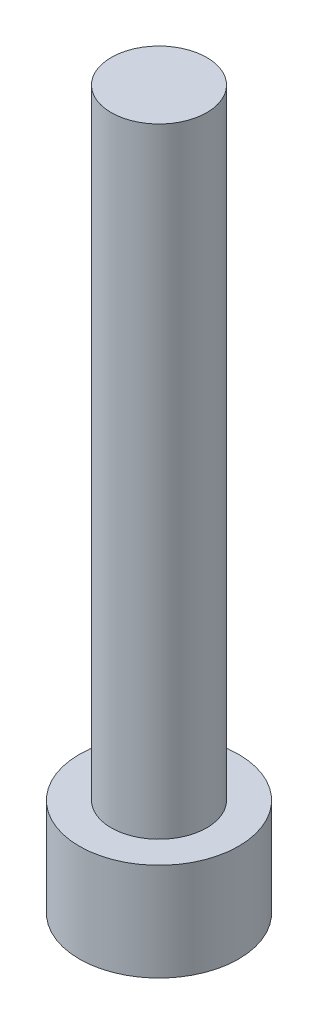
ISO-10303-21;
HEADER;
FILE_DESCRIPTION(('STEP AP214'),'2;1');
FILE_NAME('part.step','',(''),(''),'','','');
FILE_SCHEMA(('AUTOMOTIVE_DESIGN { 1 0 10303 214 1 1 1 1 }'));
ENDSEC;
DATA;
#1=APPLICATION_CONTEXT('core data for automotive mechanical design processes');
#2=APPLICATION_PROTOCOL_DEFINITION('international standard','automotive_design',2000,#1);
#3=PRODUCT_CONTEXT('',#1,'mechanical');
#4=PRODUCT('Part','Part','',(#3));
#5=PRODUCT_RELATED_PRODUCT_CATEGORY('part','',(#4));
#6=PRODUCT_DEFINITION_FORMATION('','',#4);
#7=PRODUCT_DEFINITION_CONTEXT('part definition',#1,'design');
#8=PRODUCT_DEFINITION('design','',#6,#7);
#9=PRODUCT_DEFINITION_SHAPE('','',#8);
#10=(LENGTH_UNIT() NAMED_UNIT(*) SI_UNIT(.MILLI.,.METRE.));
#11=(NAMED_UNIT(*) PLANE_ANGLE_UNIT() SI_UNIT($,.RADIAN.));
#12=(NAMED_UNIT(*) SI_UNIT($,.STERADIAN.) SOLID_ANGLE_UNIT());
#13=UNCERTAINTY_MEASURE_WITH_UNIT(LENGTH_MEASURE(1.E-05),#10,'distance_accuracy_value','');
#14=(GEOMETRIC_REPRESENTATION_CONTEXT(3) GLOBAL_UNCERTAINTY_ASSIGNED_CONTEXT((#13)) GLOBAL_UNIT_ASSIGNED_CONTEXT((#10,
#11,#12)) REPRESENTATION_CONTEXT('',''));
#15=CARTESIAN_POINT('',(0.,0.,0.));
#16=DIRECTION('',(0.,0.,1.));
#17=DIRECTION('',(1.,0.,0.));
#18=AXIS2_PLACEMENT_3D('',#15,#16,#17);
#19=CARTESIAN_POINT('',(0.,3.5052,0.));
#20=DIRECTION('',(0.,1.,0.));
#21=DIRECTION('',(0.,0.,1.));
#22=AXIS2_PLACEMENT_3D('',#19,#20,#21);
#23=PLANE('',#22);
#24=CARTESIAN_POINT('',(0.,3.5052,0.));
#25=DIRECTION('',(0.,1.,0.));
#26=DIRECTION('',(0.,0.,1.));
#27=AXIS2_PLACEMENT_3D('',#24,#25,#26);
#28=CIRCLE('',#27,2.8575);
#29=CARTESIAN_POINT('',(0.,3.5052,2.8575));
#30=VERTEX_POINT('',#29);
#31=EDGE_CURVE('E11',#30,#30,#28,.T.);
#32=ORIENTED_EDGE('',*,*,#31,.T.);
#33=EDGE_LOOP('',(#32));
#34=FACE_BOUND('',#33,.T.);
#35=CARTESIAN_POINT('',(0.,3.5052,0.));
#36=DIRECTION('',(0.,1.,0.));
#37=DIRECTION('',(0.,0.,1.));
#38=AXIS2_PLACEMENT_3D('',#35,#36,#37);
#39=CIRCLE('',#38,1.7145);
#40=CARTESIAN_POINT('',(0.,3.5052,1.7145));
#41=VERTEX_POINT('',#40);
#42=EDGE_CURVE('E152',#41,#41,#39,.T.);
#43=ORIENTED_EDGE('',*,*,#42,.F.);
#44=EDGE_LOOP('',(#43));
#45=FACE_BOUND('',#44,.T.);
#46=ADVANCED_FACE('F33',(#34,#45),#23,.T.);
#47=CARTESIAN_POINT('',(0.,3.5052,0.));
#48=DIRECTION('',(0.,-1.,0.));
#49=DIRECTION('',(0.,0.,-1.));
#50=AXIS2_PLACEMENT_3D('',#47,#48,#49);
#51=CYLINDRICAL_SURFACE('',#50,2.8575);
#52=ORIENTED_EDGE('',*,*,#31,.F.);
#53=EDGE_LOOP('',(#52));
#54=FACE_BOUND('',#53,.T.);
#55=CARTESIAN_POINT('',(0.,0.,0.));
#56=DIRECTION('',(0.,1.,0.));
#57=DIRECTION('',(0.,0.,1.));
#58=AXIS2_PLACEMENT_3D('',#55,#56,#57);
#59=CIRCLE('',#58,2.8575);
#60=CARTESIAN_POINT('',(0.,0.,2.8575));
#61=VERTEX_POINT('',#60);
#62=EDGE_CURVE('E37',#61,#61,#59,.T.);
#63=ORIENTED_EDGE('',*,*,#62,.T.);
#64=EDGE_LOOP('',(#63));
#65=FACE_BOUND('',#64,.T.);
#66=ADVANCED_FACE('F35',(#54,#65),#51,.T.);
#67=CARTESIAN_POINT('',(0.,0.,0.));
#68=DIRECTION('',(0.,1.,0.));
#69=DIRECTION('',(0.,0.,1.));
#70=AXIS2_PLACEMENT_3D('',#67,#68,#69);
#71=PLANE('',#70);
#72=DIRECTION('',(-0.500000000000001,0.,0.866025403784438));
#73=VECTOR('',#72,1.);
#74=CARTESIAN_POINT('',(1.60395121659243,0.,0.));
#75=LINE('',#74,#73);
#76=CARTESIAN_POINT('',(1.60395121659243,0.,0.));
#77=VERTEX_POINT('',#76);
#78=CARTESIAN_POINT('',(0.801975608296214,0.,1.3890625));
#79=VERTEX_POINT('',#78);
#80=EDGE_CURVE('E122',#77,#79,#75,.T.);
#81=ORIENTED_EDGE('',*,*,#80,.F.);
#82=DIRECTION('',(0.5,0.,0.866025403784439));
#83=VECTOR('',#82,1.);
#84=CARTESIAN_POINT('',(0.801975608296215,0.,-1.3890625));
#85=LINE('',#84,#83);
#86=CARTESIAN_POINT('',(0.801975608296215,0.,-1.3890625));
#87=VERTEX_POINT('',#86);
#88=EDGE_CURVE('E48',#87,#77,#85,.T.);
#89=ORIENTED_EDGE('',*,*,#88,.F.);
#90=DIRECTION('',(1.,0.,0.));
#91=VECTOR('',#90,1.);
#92=CARTESIAN_POINT('',(-0.801975608296214,0.,-1.3890625));
#93=LINE('',#92,#91);
#94=CARTESIAN_POINT('',(-0.801975608296214,0.,-1.3890625));
#95=VERTEX_POINT('',#94);
#96=EDGE_CURVE('E132',#95,#87,#93,.T.);
#97=ORIENTED_EDGE('',*,*,#96,.F.);
#98=DIRECTION('',(0.5,0.,-0.866025403784438));
#99=VECTOR('',#98,1.);
#100=CARTESIAN_POINT('',(-1.60395121659243,0.,0.));
#101=LINE('',#100,#99);
#102=CARTESIAN_POINT('',(-1.60395121659243,0.,0.));
#103=VERTEX_POINT('',#102);
#104=EDGE_CURVE('E130',#103,#95,#101,.T.);
#105=ORIENTED_EDGE('',*,*,#104,.F.);
#106=DIRECTION('',(-0.5,0.,-0.866025403784439));
#107=VECTOR('',#106,1.);
#108=CARTESIAN_POINT('',(-0.801975608296214,0.,1.3890625));
#109=LINE('',#108,#107);
#110=CARTESIAN_POINT('',(-0.801975608296214,0.,1.3890625));
#111=VERTEX_POINT('',#110);
#112=EDGE_CURVE('E96',#111,#103,#109,.T.);
#113=ORIENTED_EDGE('',*,*,#112,.F.);
#114=DIRECTION('',(-1.,0.,0.));
#115=VECTOR('',#114,1.);
#116=CARTESIAN_POINT('',(0.801975608296214,0.,1.3890625));
#117=LINE('',#116,#115);
#118=EDGE_CURVE('E126',#79,#111,#117,.T.);
#119=ORIENTED_EDGE('',*,*,#118,.F.);
#120=EDGE_LOOP('',(#81,#89,#97,#105,#113,#119));
#121=FACE_BOUND('',#120,.T.);
#122=ORIENTED_EDGE('',*,*,#62,.F.);
#123=EDGE_LOOP('',(#122));
#124=FACE_BOUND('',#123,.T.);
#125=ADVANCED_FACE('F145',(#121,#124),#71,.F.);
#126=CARTESIAN_POINT('',(0.801975608296215,1.9558,-1.3890625));
#127=DIRECTION('',(0.866025403784438,0.,-0.5));
#128=DIRECTION('',(-0.5,0.,-0.866025403784439));
#129=AXIS2_PLACEMENT_3D('',#126,#127,#128);
#130=PLANE('',#129);
#131=ORIENTED_EDGE('',*,*,#88,.T.);
#132=DIRECTION('',(0.,-1.,0.));
#133=VECTOR('',#132,1.);
#134=CARTESIAN_POINT('',(1.60395121659243,1.9558,0.));
#135=LINE('',#134,#133);
#136=CARTESIAN_POINT('',(1.60395121659243,1.9558,0.));
#137=VERTEX_POINT('',#136);
#138=EDGE_CURVE('E78',#137,#77,#135,.T.);
#139=ORIENTED_EDGE('',*,*,#138,.F.);
#140=DIRECTION('',(0.5,0.,0.866025403784439));
#141=VECTOR('',#140,1.);
#142=CARTESIAN_POINT('',(0.801975608296215,1.9558,-1.3890625));
#143=LINE('',#142,#141);
#144=CARTESIAN_POINT('',(0.801975608296215,1.9558,-1.3890625));
#145=VERTEX_POINT('',#144);
#146=EDGE_CURVE('E134',#145,#137,#143,.T.);
#147=ORIENTED_EDGE('',*,*,#146,.F.);
#148=DIRECTION('',(0.,-1.,0.));
#149=VECTOR('',#148,1.);
#150=CARTESIAN_POINT('',(0.801975608296215,1.9558,-1.3890625));
#151=LINE('',#150,#149);
#152=EDGE_CURVE('E56',#145,#87,#151,.T.);
#153=ORIENTED_EDGE('',*,*,#152,.T.);
#154=EDGE_LOOP('',(#131,#139,#147,#153));
#155=FACE_BOUND('',#154,.T.);
#156=ADVANCED_FACE('F174',(#155),#130,.F.);
#157=CARTESIAN_POINT('',(-0.801975608296214,1.9558,-1.3890625));
#158=DIRECTION('',(0.,0.,-1.));
#159=DIRECTION('',(-1.,0.,0.));
#160=AXIS2_PLACEMENT_3D('',#157,#158,#159);
#161=PLANE('',#160);
#162=ORIENTED_EDGE('',*,*,#96,.T.);
#163=ORIENTED_EDGE('',*,*,#152,.F.);
#164=DIRECTION('',(1.,0.,0.));
#165=VECTOR('',#164,1.);
#166=CARTESIAN_POINT('',(-0.801975608296214,1.9558,-1.3890625));
#167=LINE('',#166,#165);
#168=CARTESIAN_POINT('',(-0.801975608296214,1.9558,-1.3890625));
#169=VERTEX_POINT('',#168);
#170=EDGE_CURVE('E108',#169,#145,#167,.T.);
#171=ORIENTED_EDGE('',*,*,#170,.F.);
#172=DIRECTION('',(0.,-1.,0.));
#173=VECTOR('',#172,1.);
#174=CARTESIAN_POINT('',(-0.801975608296214,1.9558,-1.3890625));
#175=LINE('',#174,#173);
#176=EDGE_CURVE('E100',#169,#95,#175,.T.);
#177=ORIENTED_EDGE('',*,*,#176,.T.);
#178=EDGE_LOOP('',(#162,#163,#171,#177));
#179=FACE_BOUND('',#178,.T.);
#180=ADVANCED_FACE('F180',(#179),#161,.F.);
#181=CARTESIAN_POINT('',(-1.60395121659243,1.9558,0.));
#182=DIRECTION('',(-0.866025403784438,0.,-0.5));
#183=DIRECTION('',(-0.5,0.,0.866025403784439));
#184=AXIS2_PLACEMENT_3D('',#181,#182,#183);
#185=PLANE('',#184);
#186=ORIENTED_EDGE('',*,*,#104,.T.);
#187=ORIENTED_EDGE('',*,*,#176,.F.);
#188=DIRECTION('',(0.5,0.,-0.866025403784438));
#189=VECTOR('',#188,1.);
#190=CARTESIAN_POINT('',(-1.60395121659243,1.9558,0.));
#191=LINE('',#190,#189);
#192=CARTESIAN_POINT('',(-1.60395121659243,1.9558,0.));
#193=VERTEX_POINT('',#192);
#194=EDGE_CURVE('E104',#193,#169,#191,.T.);
#195=ORIENTED_EDGE('',*,*,#194,.F.);
#196=DIRECTION('',(0.,-1.,0.));
#197=VECTOR('',#196,1.);
#198=CARTESIAN_POINT('',(-1.60395121659243,1.9558,0.));
#199=LINE('',#198,#197);
#200=EDGE_CURVE('E89',#193,#103,#199,.T.);
#201=ORIENTED_EDGE('',*,*,#200,.T.);
#202=EDGE_LOOP('',(#186,#187,#195,#201));
#203=FACE_BOUND('',#202,.T.);
#204=ADVANCED_FACE('F105',(#203),#185,.F.);
#205=CARTESIAN_POINT('',(-0.801975608296214,1.9558,1.3890625));
#206=DIRECTION('',(-0.866025403784439,0.,0.5));
#207=DIRECTION('',(0.5,0.,0.866025403784439));
#208=AXIS2_PLACEMENT_3D('',#205,#206,#207);
#209=PLANE('',#208);
#210=ORIENTED_EDGE('',*,*,#112,.T.);
#211=ORIENTED_EDGE('',*,*,#200,.F.);
#212=DIRECTION('',(-0.5,0.,-0.866025403784439));
#213=VECTOR('',#212,1.);
#214=CARTESIAN_POINT('',(-0.801975608296214,1.9558,1.3890625));
#215=LINE('',#214,#213);
#216=CARTESIAN_POINT('',(-0.801975608296214,1.9558,1.3890625));
#217=VERTEX_POINT('',#216);
#218=EDGE_CURVE('E93',#217,#193,#215,.T.);
#219=ORIENTED_EDGE('',*,*,#218,.F.);
#220=DIRECTION('',(0.,-1.,0.));
#221=VECTOR('',#220,1.);
#222=CARTESIAN_POINT('',(-0.801975608296214,1.9558,1.3890625));
#223=LINE('',#222,#221);
#224=EDGE_CURVE('E101',#217,#111,#223,.T.);
#225=ORIENTED_EDGE('',*,*,#224,.T.);
#226=EDGE_LOOP('',(#210,#211,#219,#225));
#227=FACE_BOUND('',#226,.T.);
#228=ADVANCED_FACE('F91',(#227),#209,.F.);
#229=CARTESIAN_POINT('',(0.801975608296214,1.9558,1.3890625));
#230=DIRECTION('',(0.,0.,1.));
#231=DIRECTION('',(1.,0.,0.));
#232=AXIS2_PLACEMENT_3D('',#229,#230,#231);
#233=PLANE('',#232);
#234=ORIENTED_EDGE('',*,*,#118,.T.);
#235=ORIENTED_EDGE('',*,*,#224,.F.);
#236=DIRECTION('',(-1.,0.,0.));
#237=VECTOR('',#236,1.);
#238=CARTESIAN_POINT('',(0.801975608296214,1.9558,1.3890625));
#239=LINE('',#238,#237);
#240=CARTESIAN_POINT('',(0.801975608296214,1.9558,1.3890625));
#241=VERTEX_POINT('',#240);
#242=EDGE_CURVE('E114',#241,#217,#239,.T.);
#243=ORIENTED_EDGE('',*,*,#242,.F.);
#244=DIRECTION('',(0.,-1.,0.));
#245=VECTOR('',#244,1.);
#246=CARTESIAN_POINT('',(0.801975608296214,1.9558,1.3890625));
#247=LINE('',#246,#245);
#248=EDGE_CURVE('E138',#241,#79,#247,.T.);
#249=ORIENTED_EDGE('',*,*,#248,.T.);
#250=EDGE_LOOP('',(#234,#235,#243,#249));
#251=FACE_BOUND('',#250,.T.);
#252=ADVANCED_FACE('F149',(#251),#233,.F.);
#253=CARTESIAN_POINT('',(1.60395121659243,1.9558,0.));
#254=DIRECTION('',(0.866025403784438,0.,0.500000000000001));
#255=DIRECTION('',(0.500000000000001,0.,-0.866025403784438));
#256=AXIS2_PLACEMENT_3D('',#253,#254,#255);
#257=PLANE('',#256);
#258=ORIENTED_EDGE('',*,*,#80,.T.);
#259=ORIENTED_EDGE('',*,*,#248,.F.);
#260=DIRECTION('',(-0.500000000000001,0.,0.866025403784438));
#261=VECTOR('',#260,1.);
#262=CARTESIAN_POINT('',(1.60395121659243,1.9558,0.));
#263=LINE('',#262,#261);
#264=EDGE_CURVE('E116',#137,#241,#263,.T.);
#265=ORIENTED_EDGE('',*,*,#264,.F.);
#266=ORIENTED_EDGE('',*,*,#138,.T.);
#267=EDGE_LOOP('',(#258,#259,#265,#266));
#268=FACE_BOUND('',#267,.T.);
#269=ADVANCED_FACE('F142',(#268),#257,.F.);
#270=CARTESIAN_POINT('',(0.,1.9558,0.));
#271=DIRECTION('',(0.,-1.,0.));
#272=DIRECTION('',(0.,0.,-1.));
#273=AXIS2_PLACEMENT_3D('',#270,#271,#272);
#274=PLANE('',#273);
#275=ORIENTED_EDGE('',*,*,#146,.T.);
#276=ORIENTED_EDGE('',*,*,#264,.T.);
#277=ORIENTED_EDGE('',*,*,#242,.T.);
#278=ORIENTED_EDGE('',*,*,#218,.T.);
#279=ORIENTED_EDGE('',*,*,#194,.T.);
#280=ORIENTED_EDGE('',*,*,#170,.T.);
#281=EDGE_LOOP('',(#275,#276,#277,#278,#279,#280));
#282=FACE_BOUND('',#281,.T.);
#283=ADVANCED_FACE('F111',(#282),#274,.T.);
#284=CARTESIAN_POINT('',(0.,25.7302,0.));
#285=DIRECTION('',(0.,-1.,0.));
#286=DIRECTION('',(0.,0.,-1.));
#287=AXIS2_PLACEMENT_3D('',#284,#285,#286);
#288=CYLINDRICAL_SURFACE('',#287,1.7145);
#289=CARTESIAN_POINT('',(0.,25.7302,0.));
#290=DIRECTION('',(0.,1.,0.));
#291=DIRECTION('',(0.,0.,1.));
#292=AXIS2_PLACEMENT_3D('',#289,#290,#291);
#293=CIRCLE('',#292,1.7145);
#294=CARTESIAN_POINT('',(0.,25.7302,1.7145));
#295=VERTEX_POINT('',#294);
#296=EDGE_CURVE('E123',#295,#295,#293,.T.);
#297=ORIENTED_EDGE('',*,*,#296,.F.);
#298=EDGE_LOOP('',(#297));
#299=FACE_BOUND('',#298,.T.);
#300=ORIENTED_EDGE('',*,*,#42,.T.);
#301=EDGE_LOOP('',(#300));
#302=FACE_BOUND('',#301,.T.);
#303=ADVANCED_FACE('F160',(#299,#302),#288,.T.);
#304=CARTESIAN_POINT('',(0.,25.7302,0.));
#305=DIRECTION('',(0.,1.,0.));
#306=DIRECTION('',(0.,0.,1.));
#307=AXIS2_PLACEMENT_3D('',#304,#305,#306);
#308=PLANE('',#307);
#309=ORIENTED_EDGE('',*,*,#296,.T.);
#310=EDGE_LOOP('',(#309));
#311=FACE_BOUND('',#310,.T.);
#312=ADVANCED_FACE('F158',(#311),#308,.T.);
#313=CLOSED_SHELL('',(#46,#66,#125,#156,#180,#204,#228,#252,#269,#283,#303,#312));
#314=MANIFOLD_SOLID_BREP('B2',#313);
#315=ADVANCED_BREP_SHAPE_REPRESENTATION('',(#18,#314),#14);
#316=SHAPE_DEFINITION_REPRESENTATION(#9,#315);
ENDSEC;
END-ISO-10303-21;
